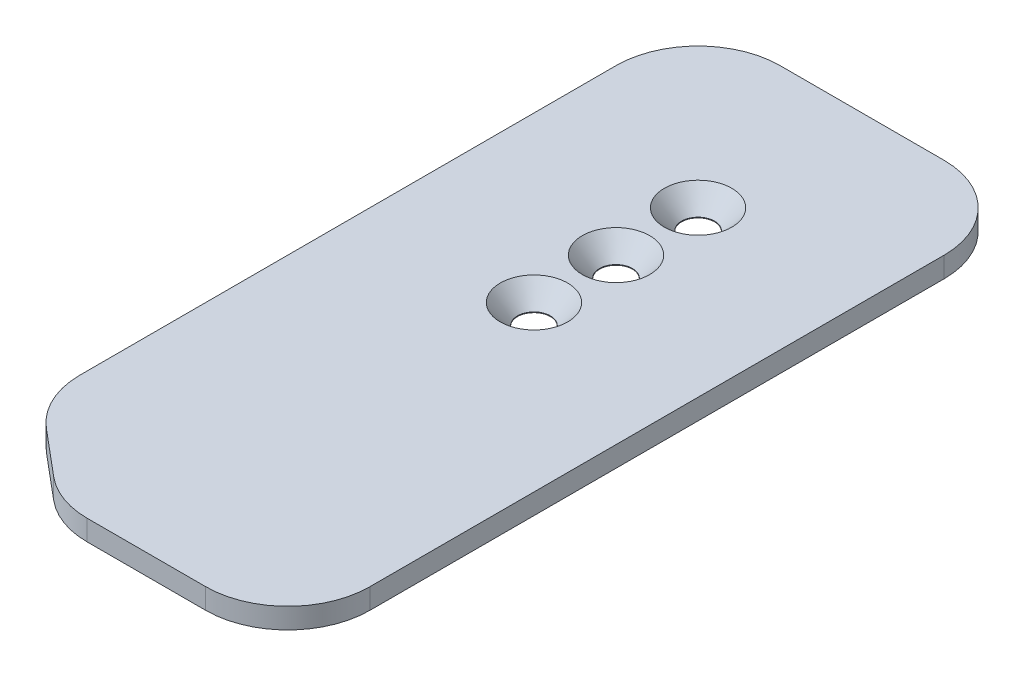
ISO-10303-21;
HEADER;
FILE_DESCRIPTION(('STEP AP214'),'2;1');
FILE_NAME('part.step','',(''),(''),'','','');
FILE_SCHEMA(('AUTOMOTIVE_DESIGN { 1 0 10303 214 1 1 1 1 }'));
ENDSEC;
DATA;
#1=APPLICATION_CONTEXT('core data for automotive mechanical design processes');
#2=APPLICATION_PROTOCOL_DEFINITION('international standard','automotive_design',2000,#1);
#3=PRODUCT_CONTEXT('',#1,'mechanical');
#4=PRODUCT('Part','Part','',(#3));
#5=PRODUCT_RELATED_PRODUCT_CATEGORY('part','',(#4));
#6=PRODUCT_DEFINITION_FORMATION('','',#4);
#7=PRODUCT_DEFINITION_CONTEXT('part definition',#1,'design');
#8=PRODUCT_DEFINITION('design','',#6,#7);
#9=PRODUCT_DEFINITION_SHAPE('','',#8);
#10=(LENGTH_UNIT() NAMED_UNIT(*) SI_UNIT(.MILLI.,.METRE.));
#11=(NAMED_UNIT(*) PLANE_ANGLE_UNIT() SI_UNIT($,.RADIAN.));
#12=(NAMED_UNIT(*) SI_UNIT($,.STERADIAN.) SOLID_ANGLE_UNIT());
#13=UNCERTAINTY_MEASURE_WITH_UNIT(LENGTH_MEASURE(1.E-05),#10,'distance_accuracy_value','');
#14=(GEOMETRIC_REPRESENTATION_CONTEXT(3) GLOBAL_UNCERTAINTY_ASSIGNED_CONTEXT((#13)) GLOBAL_UNIT_ASSIGNED_CONTEXT((#10,
#11,#12)) REPRESENTATION_CONTEXT('',''));
#15=CARTESIAN_POINT('',(0.,0.,0.));
#16=DIRECTION('',(0.,0.,1.));
#17=DIRECTION('',(1.,0.,0.));
#18=AXIS2_PLACEMENT_3D('',#15,#16,#17);
#19=CARTESIAN_POINT('',(-35.6647293740536,3.175,0.));
#20=DIRECTION('',(0.,0.,-1.));
#21=DIRECTION('',(-1.,0.,0.));
#22=AXIS2_PLACEMENT_3D('',#19,#20,#21);
#23=PLANE('',#22);
#24=DIRECTION('',(1.,0.,0.));
#25=VECTOR('',#24,1.);
#26=CARTESIAN_POINT('',(-35.6647293740536,0.,0.));
#27=LINE('',#26,#25);
#28=CARTESIAN_POINT('',(-31.0423073988728,0.,0.));
#29=VERTEX_POINT('',#28);
#30=CARTESIAN_POINT('',(-12.7,0.,0.));
#31=VERTEX_POINT('',#30);
#32=EDGE_CURVE('E181',#29,#31,#27,.T.);
#33=ORIENTED_EDGE('',*,*,#32,.T.);
#34=DIRECTION('',(0.,-1.,0.));
#35=VECTOR('',#34,1.);
#36=CARTESIAN_POINT('',(-12.7,3.175,0.));
#37=LINE('',#36,#35);
#38=CARTESIAN_POINT('',(-12.7,3.175,0.));
#39=VERTEX_POINT('',#38);
#40=EDGE_CURVE('E173',#31,#39,#37,.F.);
#41=ORIENTED_EDGE('',*,*,#40,.T.);
#42=DIRECTION('',(1.,0.,0.));
#43=VECTOR('',#42,1.);
#44=CARTESIAN_POINT('',(-35.6647293740536,3.175,0.));
#45=LINE('',#44,#43);
#46=CARTESIAN_POINT('',(-31.0423073988728,3.175,0.));
#47=VERTEX_POINT('',#46);
#48=EDGE_CURVE('E140',#47,#39,#45,.T.);
#49=ORIENTED_EDGE('',*,*,#48,.F.);
#50=DIRECTION('',(0.,-1.,0.));
#51=VECTOR('',#50,1.);
#52=CARTESIAN_POINT('',(-31.0423073988728,3.175,0.));
#53=LINE('',#52,#51);
#54=EDGE_CURVE('E170',#47,#29,#53,.T.);
#55=ORIENTED_EDGE('',*,*,#54,.T.);
#56=EDGE_LOOP('',(#33,#41,#49,#55));
#57=FACE_BOUND('',#56,.T.);
#58=ADVANCED_FACE('F33',(#57),#23,.F.);
#59=CARTESIAN_POINT('',(0.,3.175,0.));
#60=DIRECTION('',(-1.,0.,0.));
#61=DIRECTION('',(0.,0.,1.));
#62=AXIS2_PLACEMENT_3D('',#59,#60,#61);
#63=PLANE('',#62);
#64=DIRECTION('',(0.,0.,-1.));
#65=VECTOR('',#64,1.);
#66=CARTESIAN_POINT('',(0.,0.,0.));
#67=LINE('',#66,#65);
#68=CARTESIAN_POINT('',(0.,0.,-12.7));
#69=VERTEX_POINT('',#68);
#70=CARTESIAN_POINT('',(0.,0.,-101.6));
#71=VERTEX_POINT('',#70);
#72=EDGE_CURVE('E142',#69,#71,#67,.T.);
#73=ORIENTED_EDGE('',*,*,#72,.T.);
#74=DIRECTION('',(0.,-1.,0.));
#75=VECTOR('',#74,1.);
#76=CARTESIAN_POINT('',(0.,3.175,-101.6));
#77=LINE('',#76,#75);
#78=CARTESIAN_POINT('',(0.,3.175,-101.6));
#79=VERTEX_POINT('',#78);
#80=EDGE_CURVE('E168',#71,#79,#77,.F.);
#81=ORIENTED_EDGE('',*,*,#80,.T.);
#82=DIRECTION('',(0.,0.,-1.));
#83=VECTOR('',#82,1.);
#84=CARTESIAN_POINT('',(0.,3.175,0.));
#85=LINE('',#84,#83);
#86=CARTESIAN_POINT('',(0.,3.175,-12.7));
#87=VERTEX_POINT('',#86);
#88=EDGE_CURVE('E189',#87,#79,#85,.T.);
#89=ORIENTED_EDGE('',*,*,#88,.F.);
#90=DIRECTION('',(0.,-1.,0.));
#91=VECTOR('',#90,1.);
#92=CARTESIAN_POINT('',(0.,3.175,-12.7));
#93=LINE('',#92,#91);
#94=EDGE_CURVE('E165',#87,#69,#93,.T.);
#95=ORIENTED_EDGE('',*,*,#94,.T.);
#96=EDGE_LOOP('',(#73,#81,#89,#95));
#97=FACE_BOUND('',#96,.T.);
#98=ADVANCED_FACE('F196',(#97),#63,.F.);
#99=CARTESIAN_POINT('',(0.,3.175,-114.3));
#100=DIRECTION('',(0.,0.,1.));
#101=DIRECTION('',(1.,0.,0.));
#102=AXIS2_PLACEMENT_3D('',#99,#100,#101);
#103=PLANE('',#102);
#104=DIRECTION('',(-1.,0.,0.));
#105=VECTOR('',#104,1.);
#106=CARTESIAN_POINT('',(0.,0.,-114.3));
#107=LINE('',#106,#105);
#108=CARTESIAN_POINT('',(-12.7,0.,-114.3));
#109=VERTEX_POINT('',#108);
#110=CARTESIAN_POINT('',(-38.1,0.,-114.3));
#111=VERTEX_POINT('',#110);
#112=EDGE_CURVE('E138',#109,#111,#107,.T.);
#113=ORIENTED_EDGE('',*,*,#112,.T.);
#114=DIRECTION('',(0.,-1.,0.));
#115=VECTOR('',#114,1.);
#116=CARTESIAN_POINT('',(-38.1,3.175,-114.3));
#117=LINE('',#116,#115);
#118=CARTESIAN_POINT('',(-38.1,3.175,-114.3));
#119=VERTEX_POINT('',#118);
#120=EDGE_CURVE('E116',#111,#119,#117,.F.);
#121=ORIENTED_EDGE('',*,*,#120,.T.);
#122=DIRECTION('',(-1.,0.,0.));
#123=VECTOR('',#122,1.);
#124=CARTESIAN_POINT('',(0.,3.175,-114.3));
#125=LINE('',#124,#123);
#126=CARTESIAN_POINT('',(-12.7,3.175,-114.3));
#127=VERTEX_POINT('',#126);
#128=EDGE_CURVE('E203',#127,#119,#125,.T.);
#129=ORIENTED_EDGE('',*,*,#128,.F.);
#130=DIRECTION('',(0.,-1.,0.));
#131=VECTOR('',#130,1.);
#132=CARTESIAN_POINT('',(-12.7,3.175,-114.3));
#133=LINE('',#132,#131);
#134=EDGE_CURVE('E121',#127,#109,#133,.T.);
#135=ORIENTED_EDGE('',*,*,#134,.T.);
#136=EDGE_LOOP('',(#113,#121,#129,#135));
#137=FACE_BOUND('',#136,.T.);
#138=ADVANCED_FACE('F264',(#137),#103,.F.);
#139=CARTESIAN_POINT('',(-50.8,3.175,-114.3));
#140=DIRECTION('',(1.,0.,0.));
#141=DIRECTION('',(0.,0.,-1.));
#142=AXIS2_PLACEMENT_3D('',#139,#140,#141);
#143=PLANE('',#142);
#144=DIRECTION('',(0.,0.,1.));
#145=VECTOR('',#144,1.);
#146=CARTESIAN_POINT('',(-50.8,3.175,-114.3));
#147=LINE('',#146,#145);
#148=CARTESIAN_POINT('',(-50.8,3.175,-101.6));
#149=VERTEX_POINT('',#148);
#150=CARTESIAN_POINT('',(-50.8,3.175,-18.6221072585685));
#151=VERTEX_POINT('',#150);
#152=EDGE_CURVE('E130',#149,#151,#147,.T.);
#153=ORIENTED_EDGE('',*,*,#152,.F.);
#154=DIRECTION('',(0.,-1.,0.));
#155=VECTOR('',#154,1.);
#156=CARTESIAN_POINT('',(-50.8,3.175,-101.6));
#157=LINE('',#156,#155);
#158=CARTESIAN_POINT('',(-50.8,0.,-101.6));
#159=VERTEX_POINT('',#158);
#160=EDGE_CURVE('E115',#149,#159,#157,.T.);
#161=ORIENTED_EDGE('',*,*,#160,.T.);
#162=DIRECTION('',(0.,0.,1.));
#163=VECTOR('',#162,1.);
#164=CARTESIAN_POINT('',(-50.8,0.,-114.3));
#165=LINE('',#164,#163);
#166=CARTESIAN_POINT('',(-50.8,0.,-18.6221072585685));
#167=VERTEX_POINT('',#166);
#168=EDGE_CURVE('E128',#159,#167,#165,.T.);
#169=ORIENTED_EDGE('',*,*,#168,.T.);
#170=DIRECTION('',(0.,-1.,0.));
#171=VECTOR('',#170,1.);
#172=CARTESIAN_POINT('',(-50.8,3.175,-18.6221072585685));
#173=LINE('',#172,#171);
#174=EDGE_CURVE('E132',#167,#151,#173,.F.);
#175=ORIENTED_EDGE('',*,*,#174,.T.);
#176=EDGE_LOOP('',(#153,#161,#169,#175));
#177=FACE_BOUND('',#176,.T.);
#178=ADVANCED_FACE('F127',(#177),#143,.F.);
#179=CARTESIAN_POINT('',(-50.8,3.175,-12.7));
#180=DIRECTION('',(0.64278760968654,0.,-0.766044443118977));
#181=DIRECTION('',(-0.766044443118977,0.,-0.64278760968654));
#182=AXIS2_PLACEMENT_3D('',#179,#180,#181);
#183=PLANE('',#182);
#184=DIRECTION('',(0.766044443118977,0.,0.64278760968654));
#185=VECTOR('',#184,1.);
#186=CARTESIAN_POINT('',(-50.8,3.175,-12.7));
#187=LINE('',#186,#185);
#188=CARTESIAN_POINT('',(-46.263402643019,3.175,-8.89334283095746));
#189=VERTEX_POINT('',#188);
#190=CARTESIAN_POINT('',(-39.2057100418919,3.175,-2.97123557238899));
#191=VERTEX_POINT('',#190);
#192=EDGE_CURVE('E146',#189,#191,#187,.T.);
#193=ORIENTED_EDGE('',*,*,#192,.F.);
#194=DIRECTION('',(0.,-1.,0.));
#195=VECTOR('',#194,1.);
#196=CARTESIAN_POINT('',(-46.263402643019,3.175,-8.89334283095746));
#197=LINE('',#196,#195);
#198=CARTESIAN_POINT('',(-46.263402643019,0.,-8.89334283095746));
#199=VERTEX_POINT('',#198);
#200=EDGE_CURVE('E11',#189,#199,#197,.T.);
#201=ORIENTED_EDGE('',*,*,#200,.T.);
#202=DIRECTION('',(0.766044443118977,0.,0.64278760968654));
#203=VECTOR('',#202,1.);
#204=CARTESIAN_POINT('',(-50.8,0.,-12.7));
#205=LINE('',#204,#203);
#206=CARTESIAN_POINT('',(-39.2057100418919,0.,-2.97123557238899));
#207=VERTEX_POINT('',#206);
#208=EDGE_CURVE('E137',#199,#207,#205,.T.);
#209=ORIENTED_EDGE('',*,*,#208,.T.);
#210=DIRECTION('',(0.,-1.,0.));
#211=VECTOR('',#210,1.);
#212=CARTESIAN_POINT('',(-39.2057100418919,3.175,-2.97123557238899));
#213=LINE('',#212,#211);
#214=EDGE_CURVE('E41',#207,#191,#213,.F.);
#215=ORIENTED_EDGE('',*,*,#214,.T.);
#216=EDGE_LOOP('',(#193,#201,#209,#215));
#217=FACE_BOUND('',#216,.T.);
#218=ADVANCED_FACE('F237',(#217),#183,.F.);
#219=CARTESIAN_POINT('',(0.,3.175,0.));
#220=DIRECTION('',(0.,1.,0.));
#221=DIRECTION('',(0.,0.,1.));
#222=AXIS2_PLACEMENT_3D('',#219,#220,#221);
#223=PLANE('',#222);
#224=CARTESIAN_POINT('',(-25.4,3.175,-76.2));
#225=DIRECTION('',(0.,1.,0.));
#226=DIRECTION('',(0.,0.,1.));
#227=AXIS2_PLACEMENT_3D('',#224,#225,#226);
#228=CIRCLE('',#227,5.2197);
#229=CARTESIAN_POINT('',(-25.4,3.175,-70.9803));
#230=VERTEX_POINT('',#229);
#231=EDGE_CURVE('E229',#230,#230,#228,.T.);
#232=ORIENTED_EDGE('',*,*,#231,.F.);
#233=EDGE_LOOP('',(#232));
#234=FACE_BOUND('',#233,.T.);
#235=CARTESIAN_POINT('',(-25.4,3.175,-63.5));
#236=DIRECTION('',(0.,1.,0.));
#237=DIRECTION('',(0.,0.,1.));
#238=AXIS2_PLACEMENT_3D('',#235,#236,#237);
#239=CIRCLE('',#238,5.2197);
#240=CARTESIAN_POINT('',(-25.4,3.175,-58.2803));
#241=VERTEX_POINT('',#240);
#242=EDGE_CURVE('E220',#241,#241,#239,.T.);
#243=ORIENTED_EDGE('',*,*,#242,.F.);
#244=EDGE_LOOP('',(#243));
#245=FACE_BOUND('',#244,.T.);
#246=CARTESIAN_POINT('',(-25.4,3.175,-88.9));
#247=DIRECTION('',(0.,1.,0.));
#248=DIRECTION('',(0.,0.,1.));
#249=AXIS2_PLACEMENT_3D('',#246,#247,#248);
#250=CIRCLE('',#249,5.2197);
#251=CARTESIAN_POINT('',(-25.4,3.175,-83.6803));
#252=VERTEX_POINT('',#251);
#253=EDGE_CURVE('E211',#252,#252,#250,.T.);
#254=ORIENTED_EDGE('',*,*,#253,.F.);
#255=EDGE_LOOP('',(#254));
#256=FACE_BOUND('',#255,.T.);
#257=ORIENTED_EDGE('',*,*,#128,.T.);
#258=CARTESIAN_POINT('',(-38.1,3.175,-101.6));
#259=DIRECTION('',(0.,1.,0.));
#260=DIRECTION('',(0.,0.,1.));
#261=AXIS2_PLACEMENT_3D('',#258,#259,#260);
#262=CIRCLE('',#261,12.7);
#263=EDGE_CURVE('E163',#119,#149,#262,.T.);
#264=ORIENTED_EDGE('',*,*,#263,.T.);
#265=ORIENTED_EDGE('',*,*,#152,.T.);
#266=CARTESIAN_POINT('',(-38.1,3.175,-18.6221072585685));
#267=DIRECTION('',(0.,1.,0.));
#268=DIRECTION('',(0.,0.,1.));
#269=AXIS2_PLACEMENT_3D('',#266,#267,#268);
#270=CIRCLE('',#269,12.7);
#271=EDGE_CURVE('E54',#151,#189,#270,.T.);
#272=ORIENTED_EDGE('',*,*,#271,.T.);
#273=ORIENTED_EDGE('',*,*,#192,.T.);
#274=CARTESIAN_POINT('',(-31.0423073988728,3.175,-12.7));
#275=DIRECTION('',(0.,1.,0.));
#276=DIRECTION('',(0.,0.,1.));
#277=AXIS2_PLACEMENT_3D('',#274,#275,#276);
#278=CIRCLE('',#277,12.7);
#279=EDGE_CURVE('E156',#191,#47,#278,.T.);
#280=ORIENTED_EDGE('',*,*,#279,.T.);
#281=ORIENTED_EDGE('',*,*,#48,.T.);
#282=CARTESIAN_POINT('',(-12.7,3.175,-12.7));
#283=DIRECTION('',(0.,1.,0.));
#284=DIRECTION('',(0.,0.,1.));
#285=AXIS2_PLACEMENT_3D('',#282,#283,#284);
#286=CIRCLE('',#285,12.7);
#287=EDGE_CURVE('E159',#39,#87,#286,.T.);
#288=ORIENTED_EDGE('',*,*,#287,.T.);
#289=ORIENTED_EDGE('',*,*,#88,.T.);
#290=CARTESIAN_POINT('',(-12.7,3.175,-101.6));
#291=DIRECTION('',(0.,1.,0.));
#292=DIRECTION('',(0.,0.,1.));
#293=AXIS2_PLACEMENT_3D('',#290,#291,#292);
#294=CIRCLE('',#293,12.7);
#295=EDGE_CURVE('E161',#79,#127,#294,.T.);
#296=ORIENTED_EDGE('',*,*,#295,.T.);
#297=EDGE_LOOP('',(#257,#264,#265,#272,#273,#280,#281,#288,#289,#296));
#298=FACE_BOUND('',#297,.T.);
#299=ADVANCED_FACE('F185',(#234,#245,#256,#298),#223,.T.);
#300=CARTESIAN_POINT('',(0.,0.,0.));
#301=DIRECTION('',(0.,1.,0.));
#302=DIRECTION('',(0.,0.,1.));
#303=AXIS2_PLACEMENT_3D('',#300,#301,#302);
#304=PLANE('',#303);
#305=CARTESIAN_POINT('',(-25.4,0.,-76.2));
#306=DIRECTION('',(0.,1.,0.));
#307=DIRECTION('',(0.,0.,1.));
#308=AXIS2_PLACEMENT_3D('',#305,#306,#307);
#309=CIRCLE('',#308,2.5527);
#310=CARTESIAN_POINT('',(-25.4,0.,-73.6473));
#311=VERTEX_POINT('',#310);
#312=EDGE_CURVE('E223',#311,#311,#309,.T.);
#313=ORIENTED_EDGE('',*,*,#312,.T.);
#314=EDGE_LOOP('',(#313));
#315=FACE_BOUND('',#314,.T.);
#316=CARTESIAN_POINT('',(-25.4,0.,-63.5));
#317=DIRECTION('',(0.,1.,0.));
#318=DIRECTION('',(0.,0.,1.));
#319=AXIS2_PLACEMENT_3D('',#316,#317,#318);
#320=CIRCLE('',#319,2.5527);
#321=CARTESIAN_POINT('',(-25.4,0.,-60.9473));
#322=VERTEX_POINT('',#321);
#323=EDGE_CURVE('E214',#322,#322,#320,.T.);
#324=ORIENTED_EDGE('',*,*,#323,.T.);
#325=EDGE_LOOP('',(#324));
#326=FACE_BOUND('',#325,.T.);
#327=CARTESIAN_POINT('',(-25.4,0.,-88.9));
#328=DIRECTION('',(0.,1.,0.));
#329=DIRECTION('',(0.,0.,1.));
#330=AXIS2_PLACEMENT_3D('',#327,#328,#329);
#331=CIRCLE('',#330,2.5527);
#332=CARTESIAN_POINT('',(-25.4,0.,-86.3473));
#333=VERTEX_POINT('',#332);
#334=EDGE_CURVE('E198',#333,#333,#331,.T.);
#335=ORIENTED_EDGE('',*,*,#334,.T.);
#336=EDGE_LOOP('',(#335));
#337=FACE_BOUND('',#336,.T.);
#338=ORIENTED_EDGE('',*,*,#168,.F.);
#339=CARTESIAN_POINT('',(-38.1,0.,-101.6));
#340=DIRECTION('',(0.,1.,0.));
#341=DIRECTION('',(0.,0.,1.));
#342=AXIS2_PLACEMENT_3D('',#339,#340,#341);
#343=CIRCLE('',#342,12.7);
#344=EDGE_CURVE('E111',#159,#111,#343,.F.);
#345=ORIENTED_EDGE('',*,*,#344,.T.);
#346=ORIENTED_EDGE('',*,*,#112,.F.);
#347=CARTESIAN_POINT('',(-12.7,0.,-101.6));
#348=DIRECTION('',(0.,1.,0.));
#349=DIRECTION('',(0.,0.,1.));
#350=AXIS2_PLACEMENT_3D('',#347,#348,#349);
#351=CIRCLE('',#350,12.7);
#352=EDGE_CURVE('E122',#109,#71,#351,.F.);
#353=ORIENTED_EDGE('',*,*,#352,.T.);
#354=ORIENTED_EDGE('',*,*,#72,.F.);
#355=CARTESIAN_POINT('',(-12.7,0.,-12.7));
#356=DIRECTION('',(0.,1.,0.));
#357=DIRECTION('',(0.,0.,1.));
#358=AXIS2_PLACEMENT_3D('',#355,#356,#357);
#359=CIRCLE('',#358,12.7);
#360=EDGE_CURVE('E150',#69,#31,#359,.F.);
#361=ORIENTED_EDGE('',*,*,#360,.T.);
#362=ORIENTED_EDGE('',*,*,#32,.F.);
#363=CARTESIAN_POINT('',(-31.0423073988728,0.,-12.7));
#364=DIRECTION('',(0.,1.,0.));
#365=DIRECTION('',(0.,0.,1.));
#366=AXIS2_PLACEMENT_3D('',#363,#364,#365);
#367=CIRCLE('',#366,12.7);
#368=EDGE_CURVE('E131',#29,#207,#367,.F.);
#369=ORIENTED_EDGE('',*,*,#368,.T.);
#370=ORIENTED_EDGE('',*,*,#208,.F.);
#371=CARTESIAN_POINT('',(-38.1,0.,-18.6221072585685));
#372=DIRECTION('',(0.,1.,0.));
#373=DIRECTION('',(0.,0.,1.));
#374=AXIS2_PLACEMENT_3D('',#371,#372,#373);
#375=CIRCLE('',#374,12.7);
#376=EDGE_CURVE('E136',#199,#167,#375,.F.);
#377=ORIENTED_EDGE('',*,*,#376,.T.);
#378=EDGE_LOOP('',(#338,#345,#346,#353,#354,#361,#362,#369,#370,#377));
#379=FACE_BOUND('',#378,.T.);
#380=ADVANCED_FACE('F134',(#315,#326,#337,#379),#304,.F.);
#381=CARTESIAN_POINT('',(-25.4,3.175,-88.9));
#382=DIRECTION('',(0.,1.,0.));
#383=DIRECTION('',(0.,0.,1.));
#384=AXIS2_PLACEMENT_3D('',#381,#382,#383);
#385=CYLINDRICAL_SURFACE('',#384,2.5527);
#386=ORIENTED_EDGE('',*,*,#334,.F.);
#387=EDGE_LOOP('',(#386));
#388=FACE_BOUND('',#387,.T.);
#389=CARTESIAN_POINT('',(-25.4,0.106967457941568,-88.9));
#390=DIRECTION('',(0.,1.,0.));
#391=DIRECTION('',(0.,0.,1.));
#392=AXIS2_PLACEMENT_3D('',#389,#390,#391);
#393=CIRCLE('',#392,2.5527);
#394=CARTESIAN_POINT('',(-25.4,0.106967457941568,-86.3473));
#395=VERTEX_POINT('',#394);
#396=EDGE_CURVE('E208',#395,#395,#393,.T.);
#397=ORIENTED_EDGE('',*,*,#396,.T.);
#398=EDGE_LOOP('',(#397));
#399=FACE_BOUND('',#398,.T.);
#400=ADVANCED_FACE('F246',(#388,#399),#385,.F.);
#401=CARTESIAN_POINT('',(-25.4,3.175,-88.9));
#402=DIRECTION('',(0.,1.,0.));
#403=DIRECTION('',(0.,0.,1.));
#404=AXIS2_PLACEMENT_3D('',#401,#402,#403);
#405=CONICAL_SURFACE('',#404,5.2197,0.715584993317676);
#406=ORIENTED_EDGE('',*,*,#396,.F.);
#407=EDGE_LOOP('',(#406));
#408=FACE_BOUND('',#407,.T.);
#409=ORIENTED_EDGE('',*,*,#253,.T.);
#410=EDGE_LOOP('',(#409));
#411=FACE_BOUND('',#410,.T.);
#412=ADVANCED_FACE('F243',(#408,#411),#405,.F.);
#413=CARTESIAN_POINT('',(-25.4,3.175,-63.5));
#414=DIRECTION('',(0.,1.,0.));
#415=DIRECTION('',(0.,0.,1.));
#416=AXIS2_PLACEMENT_3D('',#413,#414,#415);
#417=CYLINDRICAL_SURFACE('',#416,2.5527);
#418=ORIENTED_EDGE('',*,*,#323,.F.);
#419=EDGE_LOOP('',(#418));
#420=FACE_BOUND('',#419,.T.);
#421=CARTESIAN_POINT('',(-25.4,0.106967457941568,-63.5));
#422=DIRECTION('',(0.,1.,0.));
#423=DIRECTION('',(0.,0.,1.));
#424=AXIS2_PLACEMENT_3D('',#421,#422,#423);
#425=CIRCLE('',#424,2.5527);
#426=CARTESIAN_POINT('',(-25.4,0.106967457941568,-60.9473));
#427=VERTEX_POINT('',#426);
#428=EDGE_CURVE('E217',#427,#427,#425,.T.);
#429=ORIENTED_EDGE('',*,*,#428,.T.);
#430=EDGE_LOOP('',(#429));
#431=FACE_BOUND('',#430,.T.);
#432=ADVANCED_FACE('F245',(#420,#431),#417,.F.);
#433=CARTESIAN_POINT('',(-25.4,3.175,-63.5));
#434=DIRECTION('',(0.,1.,0.));
#435=DIRECTION('',(0.,0.,1.));
#436=AXIS2_PLACEMENT_3D('',#433,#434,#435);
#437=CONICAL_SURFACE('',#436,5.2197,0.715584993317676);
#438=ORIENTED_EDGE('',*,*,#428,.F.);
#439=EDGE_LOOP('',(#438));
#440=FACE_BOUND('',#439,.T.);
#441=ORIENTED_EDGE('',*,*,#242,.T.);
#442=EDGE_LOOP('',(#441));
#443=FACE_BOUND('',#442,.T.);
#444=ADVANCED_FACE('F253',(#440,#443),#437,.F.);
#445=CARTESIAN_POINT('',(-25.4,3.175,-76.2));
#446=DIRECTION('',(0.,1.,0.));
#447=DIRECTION('',(0.,0.,1.));
#448=AXIS2_PLACEMENT_3D('',#445,#446,#447);
#449=CYLINDRICAL_SURFACE('',#448,2.5527);
#450=ORIENTED_EDGE('',*,*,#312,.F.);
#451=EDGE_LOOP('',(#450));
#452=FACE_BOUND('',#451,.T.);
#453=CARTESIAN_POINT('',(-25.4,0.106967457941568,-76.2));
#454=DIRECTION('',(0.,1.,0.));
#455=DIRECTION('',(0.,0.,1.));
#456=AXIS2_PLACEMENT_3D('',#453,#454,#455);
#457=CIRCLE('',#456,2.5527);
#458=CARTESIAN_POINT('',(-25.4,0.106967457941568,-73.6473));
#459=VERTEX_POINT('',#458);
#460=EDGE_CURVE('E226',#459,#459,#457,.T.);
#461=ORIENTED_EDGE('',*,*,#460,.T.);
#462=EDGE_LOOP('',(#461));
#463=FACE_BOUND('',#462,.T.);
#464=ADVANCED_FACE('F359',(#452,#463),#449,.F.);
#465=CARTESIAN_POINT('',(-25.4,3.175,-76.2));
#466=DIRECTION('',(0.,1.,0.));
#467=DIRECTION('',(0.,0.,1.));
#468=AXIS2_PLACEMENT_3D('',#465,#466,#467);
#469=CONICAL_SURFACE('',#468,5.2197,0.715584993317676);
#470=ORIENTED_EDGE('',*,*,#460,.F.);
#471=EDGE_LOOP('',(#470));
#472=FACE_BOUND('',#471,.T.);
#473=ORIENTED_EDGE('',*,*,#231,.T.);
#474=EDGE_LOOP('',(#473));
#475=FACE_BOUND('',#474,.T.);
#476=ADVANCED_FACE('F233',(#472,#475),#469,.F.);
#477=CARTESIAN_POINT('',(-38.1,3.175,-101.6));
#478=DIRECTION('',(0.,-1.,0.));
#479=DIRECTION('',(0.,0.,-1.));
#480=AXIS2_PLACEMENT_3D('',#477,#478,#479);
#481=CYLINDRICAL_SURFACE('',#480,12.7);
#482=ORIENTED_EDGE('',*,*,#263,.F.);
#483=ORIENTED_EDGE('',*,*,#120,.F.);
#484=ORIENTED_EDGE('',*,*,#344,.F.);
#485=ORIENTED_EDGE('',*,*,#160,.F.);
#486=EDGE_LOOP('',(#482,#483,#484,#485));
#487=FACE_BOUND('',#486,.T.);
#488=ADVANCED_FACE('F114',(#487),#481,.T.);
#489=CARTESIAN_POINT('',(-12.7,3.175,-101.6));
#490=DIRECTION('',(0.,-1.,0.));
#491=DIRECTION('',(0.,0.,-1.));
#492=AXIS2_PLACEMENT_3D('',#489,#490,#491);
#493=CYLINDRICAL_SURFACE('',#492,12.7);
#494=ORIENTED_EDGE('',*,*,#295,.F.);
#495=ORIENTED_EDGE('',*,*,#80,.F.);
#496=ORIENTED_EDGE('',*,*,#352,.F.);
#497=ORIENTED_EDGE('',*,*,#134,.F.);
#498=EDGE_LOOP('',(#494,#495,#496,#497));
#499=FACE_BOUND('',#498,.T.);
#500=ADVANCED_FACE('F270',(#499),#493,.T.);
#501=CARTESIAN_POINT('',(-12.7,3.175,-12.7));
#502=DIRECTION('',(0.,-1.,0.));
#503=DIRECTION('',(0.,0.,-1.));
#504=AXIS2_PLACEMENT_3D('',#501,#502,#503);
#505=CYLINDRICAL_SURFACE('',#504,12.7);
#506=ORIENTED_EDGE('',*,*,#287,.F.);
#507=ORIENTED_EDGE('',*,*,#40,.F.);
#508=ORIENTED_EDGE('',*,*,#360,.F.);
#509=ORIENTED_EDGE('',*,*,#94,.F.);
#510=EDGE_LOOP('',(#506,#507,#508,#509));
#511=FACE_BOUND('',#510,.T.);
#512=ADVANCED_FACE('F192',(#511),#505,.T.);
#513=CARTESIAN_POINT('',(-38.1,3.175,-18.6221072585685));
#514=DIRECTION('',(0.,-1.,0.));
#515=DIRECTION('',(0.,0.,-1.));
#516=AXIS2_PLACEMENT_3D('',#513,#514,#515);
#517=CYLINDRICAL_SURFACE('',#516,12.7);
#518=ORIENTED_EDGE('',*,*,#271,.F.);
#519=ORIENTED_EDGE('',*,*,#174,.F.);
#520=ORIENTED_EDGE('',*,*,#376,.F.);
#521=ORIENTED_EDGE('',*,*,#200,.F.);
#522=EDGE_LOOP('',(#518,#519,#520,#521));
#523=FACE_BOUND('',#522,.T.);
#524=ADVANCED_FACE('F275',(#523),#517,.T.);
#525=CARTESIAN_POINT('',(-31.0423073988728,3.175,-12.7));
#526=DIRECTION('',(0.,-1.,0.));
#527=DIRECTION('',(0.,0.,-1.));
#528=AXIS2_PLACEMENT_3D('',#525,#526,#527);
#529=CYLINDRICAL_SURFACE('',#528,12.7);
#530=ORIENTED_EDGE('',*,*,#279,.F.);
#531=ORIENTED_EDGE('',*,*,#214,.F.);
#532=ORIENTED_EDGE('',*,*,#368,.F.);
#533=ORIENTED_EDGE('',*,*,#54,.F.);
#534=EDGE_LOOP('',(#530,#531,#532,#533));
#535=FACE_BOUND('',#534,.T.);
#536=ADVANCED_FACE('F35',(#535),#529,.T.);
#537=CLOSED_SHELL('',(#58,#98,#138,#178,#218,#299,#380,#400,#412,#432,#444,#464,#476,#488,#500,
#512,#524,#536));
#538=MANIFOLD_SOLID_BREP('B2',#537);
#539=ADVANCED_BREP_SHAPE_REPRESENTATION('',(#18,#538),#14);
#540=SHAPE_DEFINITION_REPRESENTATION(#9,#539);
ENDSEC;
END-ISO-10303-21;
